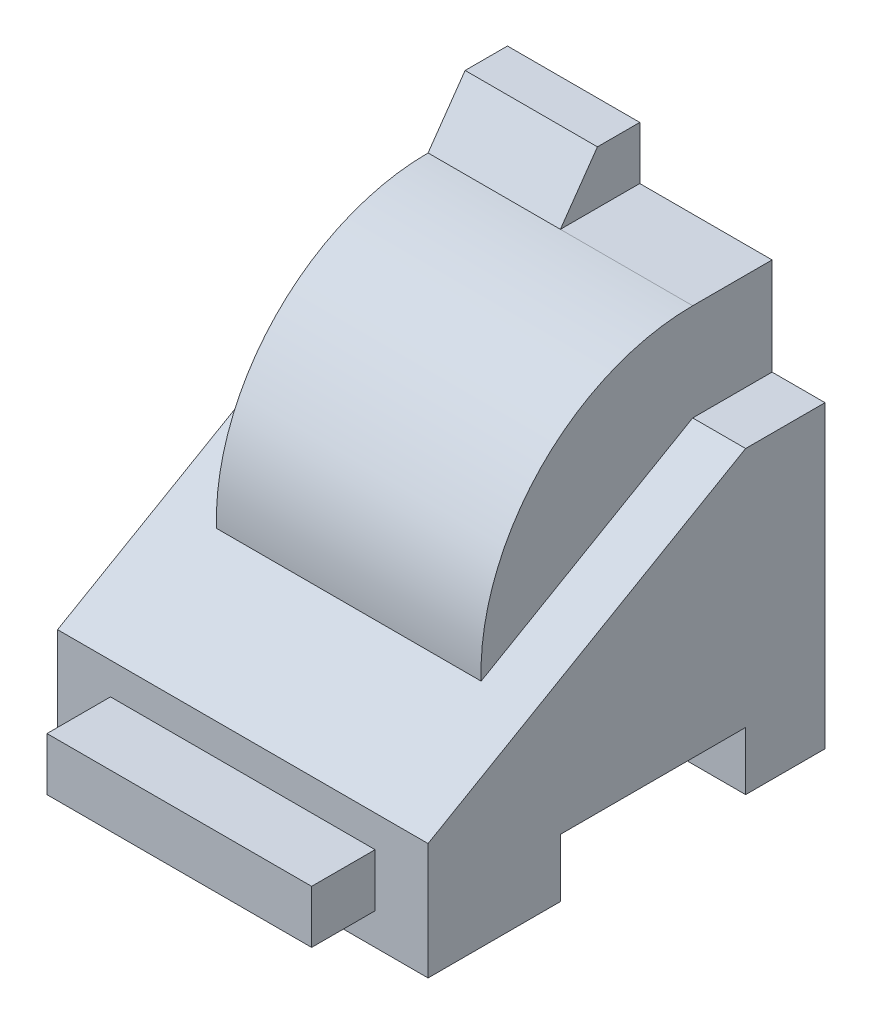
ISO-10303-21;
HEADER;
FILE_DESCRIPTION(('STEP AP214'),'2;1');
FILE_NAME('part.step','',(''),(''),'','','');
FILE_SCHEMA(('AUTOMOTIVE_DESIGN { 1 0 10303 214 1 1 1 1 }'));
ENDSEC;
DATA;
#1=APPLICATION_CONTEXT('core data for automotive mechanical design processes');
#2=APPLICATION_PROTOCOL_DEFINITION('international standard','automotive_design',2000,#1);
#3=PRODUCT_CONTEXT('',#1,'mechanical');
#4=PRODUCT('Part','Part','',(#3));
#5=PRODUCT_RELATED_PRODUCT_CATEGORY('part','',(#4));
#6=PRODUCT_DEFINITION_FORMATION('','',#4);
#7=PRODUCT_DEFINITION_CONTEXT('part definition',#1,'design');
#8=PRODUCT_DEFINITION('design','',#6,#7);
#9=PRODUCT_DEFINITION_SHAPE('','',#8);
#10=(LENGTH_UNIT() NAMED_UNIT(*) SI_UNIT(.MILLI.,.METRE.));
#11=(NAMED_UNIT(*) PLANE_ANGLE_UNIT() SI_UNIT($,.RADIAN.));
#12=(NAMED_UNIT(*) SI_UNIT($,.STERADIAN.) SOLID_ANGLE_UNIT());
#13=UNCERTAINTY_MEASURE_WITH_UNIT(LENGTH_MEASURE(1.E-05),#10,'distance_accuracy_value','');
#14=(GEOMETRIC_REPRESENTATION_CONTEXT(3) GLOBAL_UNCERTAINTY_ASSIGNED_CONTEXT((#13)) GLOBAL_UNIT_ASSIGNED_CONTEXT((#10,
#11,#12)) REPRESENTATION_CONTEXT('',''));
#15=CARTESIAN_POINT('',(0.,0.,0.));
#16=DIRECTION('',(0.,0.,1.));
#17=DIRECTION('',(1.,0.,0.));
#18=AXIS2_PLACEMENT_3D('',#15,#16,#17);
#19=CARTESIAN_POINT('',(70.,56.6410161513771,0.));
#20=DIRECTION('',(0.,-1.,0.));
#21=DIRECTION('',(0.,0.,-1.));
#22=AXIS2_PLACEMENT_3D('',#19,#20,#21);
#23=PLANE('',#22);
#24=DIRECTION('',(0.,0.,-1.));
#25=VECTOR('',#24,1.);
#26=CARTESIAN_POINT('',(10.,56.6410161513771,15.));
#27=LINE('',#26,#25);
#28=CARTESIAN_POINT('',(10.,56.6410161513771,15.));
#29=VERTEX_POINT('',#28);
#30=CARTESIAN_POINT('',(10.,56.6410161513771,0.));
#31=VERTEX_POINT('',#30);
#32=EDGE_CURVE('E241',#29,#31,#27,.T.);
#33=ORIENTED_EDGE('',*,*,#32,.T.);
#34=DIRECTION('',(-1.,0.,0.));
#35=VECTOR('',#34,1.);
#36=CARTESIAN_POINT('',(70.,56.6410161513771,0.));
#37=LINE('',#36,#35);
#38=CARTESIAN_POINT('',(0.,56.6410161513771,0.));
#39=VERTEX_POINT('',#38);
#40=EDGE_CURVE('E390',#31,#39,#37,.T.);
#41=ORIENTED_EDGE('',*,*,#40,.T.);
#42=DIRECTION('',(0.,0.,1.));
#43=VECTOR('',#42,1.);
#44=CARTESIAN_POINT('',(0.,56.6410161513771,0.));
#45=LINE('',#44,#43);
#46=CARTESIAN_POINT('',(0.,56.6410161513771,15.));
#47=VERTEX_POINT('',#46);
#48=EDGE_CURVE('E342',#39,#47,#45,.T.);
#49=ORIENTED_EDGE('',*,*,#48,.T.);
#50=DIRECTION('',(-1.,0.,0.));
#51=VECTOR('',#50,1.);
#52=CARTESIAN_POINT('',(70.,56.6410161513771,15.));
#53=LINE('',#52,#51);
#54=EDGE_CURVE('E386',#29,#47,#53,.T.);
#55=ORIENTED_EDGE('',*,*,#54,.F.);
#56=EDGE_LOOP('',(#33,#41,#49,#55));
#57=FACE_BOUND('',#56,.T.);
#58=ADVANCED_FACE('F39',(#57),#23,.F.);
#59=CARTESIAN_POINT('',(70.,22.,75.));
#60=DIRECTION('',(0.,0.,-1.));
#61=DIRECTION('',(-1.,0.,0.));
#62=AXIS2_PLACEMENT_3D('',#59,#60,#61);
#63=PLANE('',#62);
#64=DIRECTION('',(0.,-1.,0.));
#65=VECTOR('',#64,1.);
#66=CARTESIAN_POINT('',(0.,22.,75.));
#67=LINE('',#66,#65);
#68=CARTESIAN_POINT('',(0.,22.,75.));
#69=VERTEX_POINT('',#68);
#70=CARTESIAN_POINT('',(0.,0.,75.));
#71=VERTEX_POINT('',#70);
#72=EDGE_CURVE('E349',#69,#71,#67,.T.);
#73=ORIENTED_EDGE('',*,*,#72,.T.);
#74=DIRECTION('',(-1.,0.,0.));
#75=VECTOR('',#74,1.);
#76=CARTESIAN_POINT('',(70.,0.,75.));
#77=LINE('',#76,#75);
#78=CARTESIAN_POINT('',(70.,0.,75.));
#79=VERTEX_POINT('',#78);
#80=EDGE_CURVE('E378',#79,#71,#77,.T.);
#81=ORIENTED_EDGE('',*,*,#80,.F.);
#82=DIRECTION('',(0.,-1.,0.));
#83=VECTOR('',#82,1.);
#84=CARTESIAN_POINT('',(70.,22.,75.));
#85=LINE('',#84,#83);
#86=CARTESIAN_POINT('',(70.,22.,75.));
#87=VERTEX_POINT('',#86);
#88=EDGE_CURVE('E320',#87,#79,#85,.T.);
#89=ORIENTED_EDGE('',*,*,#88,.F.);
#90=DIRECTION('',(-1.,0.,0.));
#91=VECTOR('',#90,1.);
#92=CARTESIAN_POINT('',(70.,22.,75.));
#93=LINE('',#92,#91);
#94=EDGE_CURVE('E382',#87,#69,#93,.T.);
#95=ORIENTED_EDGE('',*,*,#94,.T.);
#96=EDGE_LOOP('',(#73,#81,#89,#95));
#97=FACE_BOUND('',#96,.T.);
#98=DIRECTION('',(0.,-1.,0.));
#99=VECTOR('',#98,1.);
#100=CARTESIAN_POINT('',(10.,16.,75.));
#101=LINE('',#100,#99);
#102=CARTESIAN_POINT('',(10.,16.,75.));
#103=VERTEX_POINT('',#102);
#104=CARTESIAN_POINT('',(10.,6.,75.));
#105=VERTEX_POINT('',#104);
#106=EDGE_CURVE('E260',#103,#105,#101,.T.);
#107=ORIENTED_EDGE('',*,*,#106,.F.);
#108=DIRECTION('',(-1.,0.,0.));
#109=VECTOR('',#108,1.);
#110=CARTESIAN_POINT('',(10.,16.,75.));
#111=LINE('',#110,#109);
#112=CARTESIAN_POINT('',(60.,16.,75.));
#113=VERTEX_POINT('',#112);
#114=EDGE_CURVE('E266',#113,#103,#111,.T.);
#115=ORIENTED_EDGE('',*,*,#114,.F.);
#116=DIRECTION('',(0.,1.,0.));
#117=VECTOR('',#116,1.);
#118=CARTESIAN_POINT('',(60.,16.,75.));
#119=LINE('',#118,#117);
#120=CARTESIAN_POINT('',(60.,6.,75.));
#121=VERTEX_POINT('',#120);
#122=EDGE_CURVE('E283',#121,#113,#119,.T.);
#123=ORIENTED_EDGE('',*,*,#122,.F.);
#124=DIRECTION('',(1.,0.,0.));
#125=VECTOR('',#124,1.);
#126=CARTESIAN_POINT('',(10.,6.,75.));
#127=LINE('',#126,#125);
#128=EDGE_CURVE('E279',#105,#121,#127,.T.);
#129=ORIENTED_EDGE('',*,*,#128,.F.);
#130=EDGE_LOOP('',(#107,#115,#123,#129));
#131=FACE_BOUND('',#130,.T.);
#132=ADVANCED_FACE('F414',(#97,#131),#63,.F.);
#133=CARTESIAN_POINT('',(70.,0.,15.));
#134=DIRECTION('',(0.,1.,0.));
#135=DIRECTION('',(0.,0.,1.));
#136=AXIS2_PLACEMENT_3D('',#133,#134,#135);
#137=PLANE('',#136);
#138=DIRECTION('',(0.,0.,-1.));
#139=VECTOR('',#138,1.);
#140=CARTESIAN_POINT('',(0.,0.,15.));
#141=LINE('',#140,#139);
#142=CARTESIAN_POINT('',(0.,0.,15.));
#143=VERTEX_POINT('',#142);
#144=CARTESIAN_POINT('',(0.,0.,0.));
#145=VERTEX_POINT('',#144);
#146=EDGE_CURVE('E305',#143,#145,#141,.T.);
#147=ORIENTED_EDGE('',*,*,#146,.T.);
#148=DIRECTION('',(-1.,0.,0.));
#149=VECTOR('',#148,1.);
#150=CARTESIAN_POINT('',(70.,0.,0.));
#151=LINE('',#150,#149);
#152=CARTESIAN_POINT('',(70.,0.,0.));
#153=VERTEX_POINT('',#152);
#154=EDGE_CURVE('E11',#153,#145,#151,.T.);
#155=ORIENTED_EDGE('',*,*,#154,.F.);
#156=DIRECTION('',(0.,0.,-1.));
#157=VECTOR('',#156,1.);
#158=CARTESIAN_POINT('',(70.,0.,15.));
#159=LINE('',#158,#157);
#160=CARTESIAN_POINT('',(70.,0.,15.));
#161=VERTEX_POINT('',#160);
#162=EDGE_CURVE('E306',#161,#153,#159,.T.);
#163=ORIENTED_EDGE('',*,*,#162,.F.);
#164=DIRECTION('',(-1.,0.,0.));
#165=VECTOR('',#164,1.);
#166=CARTESIAN_POINT('',(70.,0.,15.));
#167=LINE('',#166,#165);
#168=EDGE_CURVE('E335',#161,#143,#167,.T.);
#169=ORIENTED_EDGE('',*,*,#168,.T.);
#170=EDGE_LOOP('',(#147,#155,#163,#169));
#171=FACE_BOUND('',#170,.T.);
#172=ADVANCED_FACE('F41',(#171),#137,.F.);
#173=CARTESIAN_POINT('',(70.,0.,0.));
#174=DIRECTION('',(0.,0.,1.));
#175=DIRECTION('',(1.,0.,0.));
#176=AXIS2_PLACEMENT_3D('',#173,#174,#175);
#177=PLANE('',#176);
#178=DIRECTION('',(0.,1.,0.));
#179=VECTOR('',#178,1.);
#180=CARTESIAN_POINT('',(0.,0.,0.));
#181=LINE('',#180,#179);
#182=EDGE_CURVE('E339',#145,#39,#181,.T.);
#183=ORIENTED_EDGE('',*,*,#182,.T.);
#184=ORIENTED_EDGE('',*,*,#40,.F.);
#185=DIRECTION('',(0.,1.,0.));
#186=VECTOR('',#185,1.);
#187=CARTESIAN_POINT('',(10.,56.6410161513771,0.));
#188=LINE('',#187,#186);
#189=CARTESIAN_POINT('',(10.,85.,0.));
#190=VERTEX_POINT('',#189);
#191=EDGE_CURVE('E188',#31,#190,#188,.T.);
#192=ORIENTED_EDGE('',*,*,#191,.T.);
#193=DIRECTION('',(1.,0.,0.));
#194=VECTOR('',#193,1.);
#195=CARTESIAN_POINT('',(-8.02775637731994,85.,0.));
#196=LINE('',#195,#194);
#197=CARTESIAN_POINT('',(35.,85.,0.));
#198=VERTEX_POINT('',#197);
#199=EDGE_CURVE('E180',#190,#198,#196,.T.);
#200=ORIENTED_EDGE('',*,*,#199,.T.);
#201=DIRECTION('',(0.,1.,0.));
#202=VECTOR('',#201,1.);
#203=CARTESIAN_POINT('',(35.,75.,0.));
#204=LINE('',#203,#202);
#205=CARTESIAN_POINT('',(35.,75.,0.));
#206=VERTEX_POINT('',#205);
#207=EDGE_CURVE('E185',#206,#198,#204,.T.);
#208=ORIENTED_EDGE('',*,*,#207,.F.);
#209=DIRECTION('',(-1.,0.,0.));
#210=VECTOR('',#209,1.);
#211=CARTESIAN_POINT('',(60.,75.,0.));
#212=LINE('',#211,#210);
#213=CARTESIAN_POINT('',(60.,75.,0.));
#214=VERTEX_POINT('',#213);
#215=EDGE_CURVE('E55',#214,#206,#212,.T.);
#216=ORIENTED_EDGE('',*,*,#215,.F.);
#217=DIRECTION('',(0.,1.,0.));
#218=VECTOR('',#217,1.);
#219=CARTESIAN_POINT('',(60.,56.6410161513771,0.));
#220=LINE('',#219,#218);
#221=CARTESIAN_POINT('',(60.,56.6410161513771,0.));
#222=VERTEX_POINT('',#221);
#223=EDGE_CURVE('E225',#222,#214,#220,.T.);
#224=ORIENTED_EDGE('',*,*,#223,.F.);
#225=CARTESIAN_POINT('',(70.,56.6410161513771,0.));
#226=VERTEX_POINT('',#225);
#227=EDGE_CURVE('E48',#226,#222,#37,.T.);
#228=ORIENTED_EDGE('',*,*,#227,.F.);
#229=DIRECTION('',(0.,1.,0.));
#230=VECTOR('',#229,1.);
#231=CARTESIAN_POINT('',(70.,0.,0.));
#232=LINE('',#231,#230);
#233=EDGE_CURVE('E310',#153,#226,#232,.T.);
#234=ORIENTED_EDGE('',*,*,#233,.F.);
#235=ORIENTED_EDGE('',*,*,#154,.T.);
#236=EDGE_LOOP('',(#183,#184,#192,#200,#208,#216,#224,#228,#234,#235));
#237=FACE_BOUND('',#236,.T.);
#238=ADVANCED_FACE('F183',(#237),#177,.F.);
#239=ORIENTED_EDGE('',*,*,#227,.T.);
#240=DIRECTION('',(0.,0.,-1.));
#241=VECTOR('',#240,1.);
#242=CARTESIAN_POINT('',(60.,56.6410161513771,15.));
#243=LINE('',#242,#241);
#244=CARTESIAN_POINT('',(60.,56.6410161513771,15.));
#245=VERTEX_POINT('',#244);
#246=EDGE_CURVE('E221',#245,#222,#243,.T.);
#247=ORIENTED_EDGE('',*,*,#246,.F.);
#248=CARTESIAN_POINT('',(70.,56.6410161513771,15.));
#249=VERTEX_POINT('',#248);
#250=EDGE_CURVE('E387',#249,#245,#53,.T.);
#251=ORIENTED_EDGE('',*,*,#250,.F.);
#252=DIRECTION('',(0.,0.,1.));
#253=VECTOR('',#252,1.);
#254=CARTESIAN_POINT('',(70.,56.6410161513771,0.));
#255=LINE('',#254,#253);
#256=EDGE_CURVE('E314',#226,#249,#255,.T.);
#257=ORIENTED_EDGE('',*,*,#256,.F.);
#258=EDGE_LOOP('',(#239,#247,#251,#257));
#259=FACE_BOUND('',#258,.T.);
#260=ADVANCED_FACE('F453',(#259),#23,.F.);
#261=CARTESIAN_POINT('',(70.,56.6410161513771,15.));
#262=DIRECTION('',(0.,-0.866025403784441,-0.499999999999995));
#263=DIRECTION('',(0.,0.499999999999995,-0.866025403784442));
#264=AXIS2_PLACEMENT_3D('',#261,#262,#263);
#265=PLANE('',#264);
#266=ORIENTED_EDGE('',*,*,#250,.T.);
#267=DIRECTION('',(0.,0.5,-0.866025403784439));
#268=VECTOR('',#267,1.);
#269=CARTESIAN_POINT('',(60.,56.6410161513771,15.));
#270=LINE('',#269,#268);
#271=CARTESIAN_POINT('',(60.,33.5619349385911,54.9741412525542));
#272=VERTEX_POINT('',#271);
#273=EDGE_CURVE('E236',#272,#245,#270,.T.);
#274=ORIENTED_EDGE('',*,*,#273,.F.);
#275=DIRECTION('',(-1.,0.,0.));
#276=VECTOR('',#275,1.);
#277=CARTESIAN_POINT('',(60.,33.5619349385908,54.9741412525542));
#278=LINE('',#277,#276);
#279=CARTESIAN_POINT('',(10.,33.5619349385908,54.9741412525542));
#280=VERTEX_POINT('',#279);
#281=EDGE_CURVE('E240',#272,#280,#278,.T.);
#282=ORIENTED_EDGE('',*,*,#281,.T.);
#283=DIRECTION('',(0.,0.5,-0.866025403784439));
#284=VECTOR('',#283,1.);
#285=CARTESIAN_POINT('',(10.,56.6410161513771,15.));
#286=LINE('',#285,#284);
#287=EDGE_CURVE('E226',#280,#29,#286,.T.);
#288=ORIENTED_EDGE('',*,*,#287,.T.);
#289=ORIENTED_EDGE('',*,*,#54,.T.);
#290=DIRECTION('',(0.,-0.499999999999995,0.866025403784442));
#291=VECTOR('',#290,1.);
#292=CARTESIAN_POINT('',(0.,56.6410161513771,15.));
#293=LINE('',#292,#291);
#294=EDGE_CURVE('E346',#47,#69,#293,.T.);
#295=ORIENTED_EDGE('',*,*,#294,.T.);
#296=ORIENTED_EDGE('',*,*,#94,.F.);
#297=DIRECTION('',(0.,-0.499999999999995,0.866025403784442));
#298=VECTOR('',#297,1.);
#299=CARTESIAN_POINT('',(70.,56.6410161513771,15.));
#300=LINE('',#299,#298);
#301=EDGE_CURVE('E317',#249,#87,#300,.T.);
#302=ORIENTED_EDGE('',*,*,#301,.F.);
#303=EDGE_LOOP('',(#266,#274,#282,#288,#289,#295,#296,#302));
#304=FACE_BOUND('',#303,.T.);
#305=ADVANCED_FACE('F410',(#304),#265,.F.);
#306=CARTESIAN_POINT('',(70.,0.,75.));
#307=DIRECTION('',(0.,1.,0.));
#308=DIRECTION('',(0.,0.,1.));
#309=AXIS2_PLACEMENT_3D('',#306,#307,#308);
#310=PLANE('',#309);
#311=DIRECTION('',(0.,0.,-1.));
#312=VECTOR('',#311,1.);
#313=CARTESIAN_POINT('',(0.,0.,75.));
#314=LINE('',#313,#312);
#315=CARTESIAN_POINT('',(0.,0.,50.));
#316=VERTEX_POINT('',#315);
#317=EDGE_CURVE('E352',#71,#316,#314,.T.);
#318=ORIENTED_EDGE('',*,*,#317,.T.);
#319=DIRECTION('',(-1.,0.,0.));
#320=VECTOR('',#319,1.);
#321=CARTESIAN_POINT('',(70.,0.,50.));
#322=LINE('',#321,#320);
#323=CARTESIAN_POINT('',(70.,0.,50.));
#324=VERTEX_POINT('',#323);
#325=EDGE_CURVE('E374',#324,#316,#322,.T.);
#326=ORIENTED_EDGE('',*,*,#325,.F.);
#327=DIRECTION('',(0.,0.,-1.));
#328=VECTOR('',#327,1.);
#329=CARTESIAN_POINT('',(70.,0.,75.));
#330=LINE('',#329,#328);
#331=EDGE_CURVE('E323',#79,#324,#330,.T.);
#332=ORIENTED_EDGE('',*,*,#331,.F.);
#333=ORIENTED_EDGE('',*,*,#80,.T.);
#334=EDGE_LOOP('',(#318,#326,#332,#333));
#335=FACE_BOUND('',#334,.T.);
#336=ADVANCED_FACE('F464',(#335),#310,.F.);
#337=CARTESIAN_POINT('',(70.,0.,50.));
#338=DIRECTION('',(0.,0.,1.));
#339=DIRECTION('',(1.,0.,0.));
#340=AXIS2_PLACEMENT_3D('',#337,#338,#339);
#341=PLANE('',#340);
#342=DIRECTION('',(0.,1.,0.));
#343=VECTOR('',#342,1.);
#344=CARTESIAN_POINT('',(0.,0.,50.));
#345=LINE('',#344,#343);
#346=CARTESIAN_POINT('',(0.,11.,50.));
#347=VERTEX_POINT('',#346);
#348=EDGE_CURVE('E355',#316,#347,#345,.T.);
#349=ORIENTED_EDGE('',*,*,#348,.T.);
#350=DIRECTION('',(-1.,0.,0.));
#351=VECTOR('',#350,1.);
#352=CARTESIAN_POINT('',(70.,11.,50.));
#353=LINE('',#352,#351);
#354=CARTESIAN_POINT('',(70.,11.,50.));
#355=VERTEX_POINT('',#354);
#356=EDGE_CURVE('E370',#355,#347,#353,.T.);
#357=ORIENTED_EDGE('',*,*,#356,.F.);
#358=DIRECTION('',(0.,1.,0.));
#359=VECTOR('',#358,1.);
#360=CARTESIAN_POINT('',(70.,0.,50.));
#361=LINE('',#360,#359);
#362=EDGE_CURVE('E326',#324,#355,#361,.T.);
#363=ORIENTED_EDGE('',*,*,#362,.F.);
#364=ORIENTED_EDGE('',*,*,#325,.T.);
#365=EDGE_LOOP('',(#349,#357,#363,#364));
#366=FACE_BOUND('',#365,.T.);
#367=ADVANCED_FACE('F486',(#366),#341,.F.);
#368=CARTESIAN_POINT('',(70.,11.,50.));
#369=DIRECTION('',(0.,1.,0.));
#370=DIRECTION('',(0.,0.,1.));
#371=AXIS2_PLACEMENT_3D('',#368,#369,#370);
#372=PLANE('',#371);
#373=DIRECTION('',(0.,0.,-1.));
#374=VECTOR('',#373,1.);
#375=CARTESIAN_POINT('',(0.,11.,50.));
#376=LINE('',#375,#374);
#377=CARTESIAN_POINT('',(0.,11.,15.));
#378=VERTEX_POINT('',#377);
#379=EDGE_CURVE('E358',#347,#378,#376,.T.);
#380=ORIENTED_EDGE('',*,*,#379,.T.);
#381=DIRECTION('',(-1.,0.,0.));
#382=VECTOR('',#381,1.);
#383=CARTESIAN_POINT('',(70.,11.,15.));
#384=LINE('',#383,#382);
#385=CARTESIAN_POINT('',(70.,11.,15.));
#386=VERTEX_POINT('',#385);
#387=EDGE_CURVE('E366',#386,#378,#384,.T.);
#388=ORIENTED_EDGE('',*,*,#387,.F.);
#389=DIRECTION('',(0.,0.,-1.));
#390=VECTOR('',#389,1.);
#391=CARTESIAN_POINT('',(70.,11.,50.));
#392=LINE('',#391,#390);
#393=EDGE_CURVE('E329',#355,#386,#392,.T.);
#394=ORIENTED_EDGE('',*,*,#393,.F.);
#395=ORIENTED_EDGE('',*,*,#356,.T.);
#396=EDGE_LOOP('',(#380,#388,#394,#395));
#397=FACE_BOUND('',#396,.T.);
#398=ADVANCED_FACE('F482',(#397),#372,.F.);
#399=CARTESIAN_POINT('',(70.,11.,15.));
#400=DIRECTION('',(0.,0.,-1.));
#401=DIRECTION('',(-1.,0.,0.));
#402=AXIS2_PLACEMENT_3D('',#399,#400,#401);
#403=PLANE('',#402);
#404=DIRECTION('',(0.,-1.,0.));
#405=VECTOR('',#404,1.);
#406=CARTESIAN_POINT('',(0.,11.,15.));
#407=LINE('',#406,#405);
#408=EDGE_CURVE('E311',#378,#143,#407,.T.);
#409=ORIENTED_EDGE('',*,*,#408,.T.);
#410=ORIENTED_EDGE('',*,*,#168,.F.);
#411=DIRECTION('',(0.,-1.,0.));
#412=VECTOR('',#411,1.);
#413=CARTESIAN_POINT('',(70.,11.,15.));
#414=LINE('',#413,#412);
#415=EDGE_CURVE('E332',#386,#161,#414,.T.);
#416=ORIENTED_EDGE('',*,*,#415,.F.);
#417=ORIENTED_EDGE('',*,*,#387,.T.);
#418=EDGE_LOOP('',(#409,#410,#416,#417));
#419=FACE_BOUND('',#418,.T.);
#420=ADVANCED_FACE('F477',(#419),#403,.F.);
#421=CARTESIAN_POINT('',(70.,0.,0.));
#422=DIRECTION('',(1.,0.,0.));
#423=DIRECTION('',(0.,0.,-1.));
#424=AXIS2_PLACEMENT_3D('',#421,#422,#423);
#425=PLANE('',#424);
#426=ORIENTED_EDGE('',*,*,#162,.T.);
#427=ORIENTED_EDGE('',*,*,#233,.T.);
#428=ORIENTED_EDGE('',*,*,#256,.T.);
#429=ORIENTED_EDGE('',*,*,#301,.T.);
#430=ORIENTED_EDGE('',*,*,#88,.T.);
#431=ORIENTED_EDGE('',*,*,#331,.T.);
#432=ORIENTED_EDGE('',*,*,#362,.T.);
#433=ORIENTED_EDGE('',*,*,#393,.T.);
#434=ORIENTED_EDGE('',*,*,#415,.T.);
#435=EDGE_LOOP('',(#426,#427,#428,#429,#430,#431,#432,#433,#434));
#436=FACE_BOUND('',#435,.T.);
#437=ADVANCED_FACE('F419',(#436),#425,.T.);
#438=CARTESIAN_POINT('',(0.,0.,0.));
#439=DIRECTION('',(1.,0.,0.));
#440=DIRECTION('',(0.,0.,-1.));
#441=AXIS2_PLACEMENT_3D('',#438,#439,#440);
#442=PLANE('',#441);
#443=ORIENTED_EDGE('',*,*,#146,.F.);
#444=ORIENTED_EDGE('',*,*,#408,.F.);
#445=ORIENTED_EDGE('',*,*,#379,.F.);
#446=ORIENTED_EDGE('',*,*,#348,.F.);
#447=ORIENTED_EDGE('',*,*,#317,.F.);
#448=ORIENTED_EDGE('',*,*,#72,.F.);
#449=ORIENTED_EDGE('',*,*,#294,.F.);
#450=ORIENTED_EDGE('',*,*,#48,.F.);
#451=ORIENTED_EDGE('',*,*,#182,.F.);
#452=EDGE_LOOP('',(#443,#444,#445,#446,#447,#448,#449,#450,#451));
#453=FACE_BOUND('',#452,.T.);
#454=ADVANCED_FACE('F405',(#453),#442,.F.);
#455=CARTESIAN_POINT('',(10.,16.,87.));
#456=DIRECTION('',(1.,0.,0.));
#457=DIRECTION('',(0.,1.,0.));
#458=AXIS2_PLACEMENT_3D('',#455,#456,#457);
#459=PLANE('',#458);
#460=ORIENTED_EDGE('',*,*,#106,.T.);
#461=DIRECTION('',(0.,0.,-1.));
#462=VECTOR('',#461,1.);
#463=CARTESIAN_POINT('',(10.,6.,87.));
#464=LINE('',#463,#462);
#465=CARTESIAN_POINT('',(10.,6.,87.));
#466=VERTEX_POINT('',#465);
#467=EDGE_CURVE('E301',#466,#105,#464,.T.);
#468=ORIENTED_EDGE('',*,*,#467,.F.);
#469=DIRECTION('',(0.,-1.,0.));
#470=VECTOR('',#469,1.);
#471=CARTESIAN_POINT('',(10.,16.,87.));
#472=LINE('',#471,#470);
#473=CARTESIAN_POINT('',(10.,16.,87.));
#474=VERTEX_POINT('',#473);
#475=EDGE_CURVE('E261',#474,#466,#472,.T.);
#476=ORIENTED_EDGE('',*,*,#475,.F.);
#477=DIRECTION('',(0.,0.,-1.));
#478=VECTOR('',#477,1.);
#479=CARTESIAN_POINT('',(10.,16.,87.));
#480=LINE('',#479,#478);
#481=EDGE_CURVE('E275',#474,#103,#480,.T.);
#482=ORIENTED_EDGE('',*,*,#481,.T.);
#483=EDGE_LOOP('',(#460,#468,#476,#482));
#484=FACE_BOUND('',#483,.T.);
#485=ADVANCED_FACE('F501',(#484),#459,.F.);
#486=CARTESIAN_POINT('',(10.,6.,87.));
#487=DIRECTION('',(0.,1.,0.));
#488=DIRECTION('',(0.,0.,1.));
#489=AXIS2_PLACEMENT_3D('',#486,#487,#488);
#490=PLANE('',#489);
#491=ORIENTED_EDGE('',*,*,#128,.T.);
#492=DIRECTION('',(0.,0.,-1.));
#493=VECTOR('',#492,1.);
#494=CARTESIAN_POINT('',(60.,6.,87.));
#495=LINE('',#494,#493);
#496=CARTESIAN_POINT('',(60.,6.,87.));
#497=VERTEX_POINT('',#496);
#498=EDGE_CURVE('E297',#497,#121,#495,.T.);
#499=ORIENTED_EDGE('',*,*,#498,.F.);
#500=DIRECTION('',(1.,0.,0.));
#501=VECTOR('',#500,1.);
#502=CARTESIAN_POINT('',(10.,6.,87.));
#503=LINE('',#502,#501);
#504=EDGE_CURVE('E265',#466,#497,#503,.T.);
#505=ORIENTED_EDGE('',*,*,#504,.F.);
#506=ORIENTED_EDGE('',*,*,#467,.T.);
#507=EDGE_LOOP('',(#491,#499,#505,#506));
#508=FACE_BOUND('',#507,.T.);
#509=ADVANCED_FACE('F506',(#508),#490,.F.);
#510=CARTESIAN_POINT('',(60.,16.,87.));
#511=DIRECTION('',(-1.,0.,0.));
#512=DIRECTION('',(0.,0.,1.));
#513=AXIS2_PLACEMENT_3D('',#510,#511,#512);
#514=PLANE('',#513);
#515=ORIENTED_EDGE('',*,*,#122,.T.);
#516=DIRECTION('',(0.,0.,-1.));
#517=VECTOR('',#516,1.);
#518=CARTESIAN_POINT('',(60.,16.,87.));
#519=LINE('',#518,#517);
#520=CARTESIAN_POINT('',(60.,16.,87.));
#521=VERTEX_POINT('',#520);
#522=EDGE_CURVE('E293',#521,#113,#519,.T.);
#523=ORIENTED_EDGE('',*,*,#522,.F.);
#524=DIRECTION('',(0.,1.,0.));
#525=VECTOR('',#524,1.);
#526=CARTESIAN_POINT('',(60.,16.,87.));
#527=LINE('',#526,#525);
#528=EDGE_CURVE('E269',#497,#521,#527,.T.);
#529=ORIENTED_EDGE('',*,*,#528,.F.);
#530=ORIENTED_EDGE('',*,*,#498,.T.);
#531=EDGE_LOOP('',(#515,#523,#529,#530));
#532=FACE_BOUND('',#531,.T.);
#533=ADVANCED_FACE('F510',(#532),#514,.F.);
#534=CARTESIAN_POINT('',(10.,16.,87.));
#535=DIRECTION('',(0.,-1.,0.));
#536=DIRECTION('',(0.,0.,-1.));
#537=AXIS2_PLACEMENT_3D('',#534,#535,#536);
#538=PLANE('',#537);
#539=ORIENTED_EDGE('',*,*,#114,.T.);
#540=ORIENTED_EDGE('',*,*,#481,.F.);
#541=DIRECTION('',(-1.,0.,0.));
#542=VECTOR('',#541,1.);
#543=CARTESIAN_POINT('',(10.,16.,87.));
#544=LINE('',#543,#542);
#545=EDGE_CURVE('E272',#521,#474,#544,.T.);
#546=ORIENTED_EDGE('',*,*,#545,.F.);
#547=ORIENTED_EDGE('',*,*,#522,.T.);
#548=EDGE_LOOP('',(#539,#540,#546,#547));
#549=FACE_BOUND('',#548,.T.);
#550=ADVANCED_FACE('F448',(#549),#538,.F.);
#551=CARTESIAN_POINT('',(0.,0.,87.));
#552=DIRECTION('',(0.,0.,1.));
#553=DIRECTION('',(1.,0.,0.));
#554=AXIS2_PLACEMENT_3D('',#551,#552,#553);
#555=PLANE('',#554);
#556=ORIENTED_EDGE('',*,*,#475,.T.);
#557=ORIENTED_EDGE('',*,*,#504,.T.);
#558=ORIENTED_EDGE('',*,*,#528,.T.);
#559=ORIENTED_EDGE('',*,*,#545,.T.);
#560=EDGE_LOOP('',(#556,#557,#558,#559));
#561=FACE_BOUND('',#560,.T.);
#562=ADVANCED_FACE('F441',(#561),#555,.T.);
#563=CARTESIAN_POINT('',(60.,75.,15.));
#564=DIRECTION('',(0.,-1.,0.));
#565=DIRECTION('',(0.,0.,-1.));
#566=AXIS2_PLACEMENT_3D('',#563,#564,#565);
#567=PLANE('',#566);
#568=ORIENTED_EDGE('',*,*,#215,.T.);
#569=DIRECTION('',(0.,0.,-1.));
#570=VECTOR('',#569,1.);
#571=CARTESIAN_POINT('',(35.,75.,15.));
#572=LINE('',#571,#570);
#573=CARTESIAN_POINT('',(35.,75.,15.));
#574=VERTEX_POINT('',#573);
#575=EDGE_CURVE('E60',#574,#206,#572,.T.);
#576=ORIENTED_EDGE('',*,*,#575,.F.);
#577=DIRECTION('',(-1.,0.,0.));
#578=VECTOR('',#577,1.);
#579=CARTESIAN_POINT('',(60.,75.,15.));
#580=LINE('',#579,#578);
#581=CARTESIAN_POINT('',(60.,75.,15.));
#582=VERTEX_POINT('',#581);
#583=EDGE_CURVE('E255',#582,#574,#580,.T.);
#584=ORIENTED_EDGE('',*,*,#583,.F.);
#585=DIRECTION('',(0.,0.,1.));
#586=VECTOR('',#585,1.);
#587=CARTESIAN_POINT('',(60.,75.,15.));
#588=LINE('',#587,#586);
#589=EDGE_CURVE('E229',#214,#582,#588,.T.);
#590=ORIENTED_EDGE('',*,*,#589,.F.);
#591=EDGE_LOOP('',(#568,#576,#584,#590));
#592=FACE_BOUND('',#591,.T.);
#593=ADVANCED_FACE('F439',(#592),#567,.F.);
#594=CARTESIAN_POINT('',(60.,35.,15.));
#595=DIRECTION('',(-1.,0.,0.));
#596=DIRECTION('',(0.,0.,1.));
#597=AXIS2_PLACEMENT_3D('',#594,#595,#596);
#598=CYLINDRICAL_SURFACE('',#597,40.);
#599=CARTESIAN_POINT('',(10.,35.,15.));
#600=DIRECTION('',(1.,0.,0.));
#601=DIRECTION('',(0.,0.,-1.));
#602=AXIS2_PLACEMENT_3D('',#599,#600,#601);
#603=CIRCLE('',#602,40.);
#604=CARTESIAN_POINT('',(10.,75.,15.));
#605=VERTEX_POINT('',#604);
#606=EDGE_CURVE('E247',#605,#280,#603,.T.);
#607=ORIENTED_EDGE('',*,*,#606,.T.);
#608=ORIENTED_EDGE('',*,*,#281,.F.);
#609=CARTESIAN_POINT('',(60.,35.,15.));
#610=DIRECTION('',(1.,0.,0.));
#611=DIRECTION('',(0.,0.,-1.));
#612=AXIS2_PLACEMENT_3D('',#609,#610,#611);
#613=CIRCLE('',#612,40.);
#614=EDGE_CURVE('E232',#582,#272,#613,.T.);
#615=ORIENTED_EDGE('',*,*,#614,.F.);
#616=ORIENTED_EDGE('',*,*,#583,.T.);
#617=DIRECTION('',(1.,0.,0.));
#618=VECTOR('',#617,1.);
#619=CARTESIAN_POINT('',(-8.02775637731994,75.,15.));
#620=LINE('',#619,#618);
#621=EDGE_CURVE('E214',#605,#574,#620,.T.);
#622=ORIENTED_EDGE('',*,*,#621,.F.);
#623=EDGE_LOOP('',(#607,#608,#615,#616,#622));
#624=FACE_BOUND('',#623,.T.);
#625=ADVANCED_FACE('F427',(#624),#598,.T.);
#626=CARTESIAN_POINT('',(60.,35.,15.));
#627=DIRECTION('',(1.,0.,0.));
#628=DIRECTION('',(0.,0.,-1.));
#629=AXIS2_PLACEMENT_3D('',#626,#627,#628);
#630=PLANE('',#629);
#631=ORIENTED_EDGE('',*,*,#246,.T.);
#632=ORIENTED_EDGE('',*,*,#223,.T.);
#633=ORIENTED_EDGE('',*,*,#589,.T.);
#634=ORIENTED_EDGE('',*,*,#614,.T.);
#635=ORIENTED_EDGE('',*,*,#273,.T.);
#636=EDGE_LOOP('',(#631,#632,#633,#634,#635));
#637=FACE_BOUND('',#636,.T.);
#638=ADVANCED_FACE('F423',(#637),#630,.T.);
#639=CARTESIAN_POINT('',(10.,35.,15.));
#640=DIRECTION('',(1.,0.,0.));
#641=DIRECTION('',(0.,0.,-1.));
#642=AXIS2_PLACEMENT_3D('',#639,#640,#641);
#643=PLANE('',#642);
#644=ORIENTED_EDGE('',*,*,#32,.F.);
#645=ORIENTED_EDGE('',*,*,#287,.F.);
#646=ORIENTED_EDGE('',*,*,#606,.F.);
#647=DIRECTION('',(0.,0.81923192051904,-0.573462344363329));
#648=VECTOR('',#647,1.);
#649=CARTESIAN_POINT('',(10.,85.,8.));
#650=LINE('',#649,#648);
#651=CARTESIAN_POINT('',(10.,85.,8.));
#652=VERTEX_POINT('',#651);
#653=EDGE_CURVE('E244',#605,#652,#650,.T.);
#654=ORIENTED_EDGE('',*,*,#653,.T.);
#655=DIRECTION('',(0.,0.,-1.));
#656=VECTOR('',#655,1.);
#657=CARTESIAN_POINT('',(10.,85.,0.));
#658=LINE('',#657,#656);
#659=EDGE_CURVE('E218',#652,#190,#658,.T.);
#660=ORIENTED_EDGE('',*,*,#659,.T.);
#661=ORIENTED_EDGE('',*,*,#191,.F.);
#662=EDGE_LOOP('',(#644,#645,#646,#654,#660,#661));
#663=FACE_BOUND('',#662,.T.);
#664=ADVANCED_FACE('F432',(#663),#643,.F.);
#665=CARTESIAN_POINT('',(-8.02775637731994,85.,8.));
#666=DIRECTION('',(0.,0.573462344363329,0.81923192051904));
#667=DIRECTION('',(0.,-0.81923192051904,0.573462344363329));
#668=AXIS2_PLACEMENT_3D('',#665,#666,#667);
#669=PLANE('',#668);
#670=ORIENTED_EDGE('',*,*,#653,.F.);
#671=ORIENTED_EDGE('',*,*,#621,.T.);
#672=DIRECTION('',(0.,-0.81923192051904,0.573462344363329));
#673=VECTOR('',#672,1.);
#674=CARTESIAN_POINT('',(35.,85.,8.));
#675=LINE('',#674,#673);
#676=CARTESIAN_POINT('',(35.,85.,8.));
#677=VERTEX_POINT('',#676);
#678=EDGE_CURVE('E194',#677,#574,#675,.T.);
#679=ORIENTED_EDGE('',*,*,#678,.F.);
#680=DIRECTION('',(1.,0.,0.));
#681=VECTOR('',#680,1.);
#682=CARTESIAN_POINT('',(-8.02775637731994,85.,8.));
#683=LINE('',#682,#681);
#684=EDGE_CURVE('E193',#652,#677,#683,.T.);
#685=ORIENTED_EDGE('',*,*,#684,.F.);
#686=EDGE_LOOP('',(#670,#671,#679,#685));
#687=FACE_BOUND('',#686,.T.);
#688=ADVANCED_FACE('F438',(#687),#669,.T.);
#689=CARTESIAN_POINT('',(-8.02775637731994,85.,0.));
#690=DIRECTION('',(0.,1.,0.));
#691=DIRECTION('',(0.,0.,1.));
#692=AXIS2_PLACEMENT_3D('',#689,#690,#691);
#693=PLANE('',#692);
#694=ORIENTED_EDGE('',*,*,#659,.F.);
#695=ORIENTED_EDGE('',*,*,#684,.T.);
#696=DIRECTION('',(0.,0.,1.));
#697=VECTOR('',#696,1.);
#698=CARTESIAN_POINT('',(35.,85.,0.));
#699=LINE('',#698,#697);
#700=EDGE_CURVE('E197',#198,#677,#699,.T.);
#701=ORIENTED_EDGE('',*,*,#700,.F.);
#702=ORIENTED_EDGE('',*,*,#199,.F.);
#703=EDGE_LOOP('',(#694,#695,#701,#702));
#704=FACE_BOUND('',#703,.T.);
#705=ADVANCED_FACE('F198',(#704),#693,.T.);
#706=CARTESIAN_POINT('',(35.,0.,0.));
#707=DIRECTION('',(1.,0.,0.));
#708=DIRECTION('',(0.,0.,-1.));
#709=AXIS2_PLACEMENT_3D('',#706,#707,#708);
#710=PLANE('',#709);
#711=ORIENTED_EDGE('',*,*,#575,.T.);
#712=ORIENTED_EDGE('',*,*,#207,.T.);
#713=ORIENTED_EDGE('',*,*,#700,.T.);
#714=ORIENTED_EDGE('',*,*,#678,.T.);
#715=EDGE_LOOP('',(#711,#712,#713,#714));
#716=FACE_BOUND('',#715,.T.);
#717=ADVANCED_FACE('F205',(#716),#710,.T.);
#718=CLOSED_SHELL('',(#58,#132,#172,#238,#260,#305,#336,#367,#398,#420,#437,#454,#485,#509,#533,
#550,#562,#593,#625,#638,#664,#688,#705,#717));
#719=MANIFOLD_SOLID_BREP('B2',#718);
#720=ADVANCED_BREP_SHAPE_REPRESENTATION('',(#18,#719),#14);
#721=SHAPE_DEFINITION_REPRESENTATION(#9,#720);
ENDSEC;
END-ISO-10303-21;
